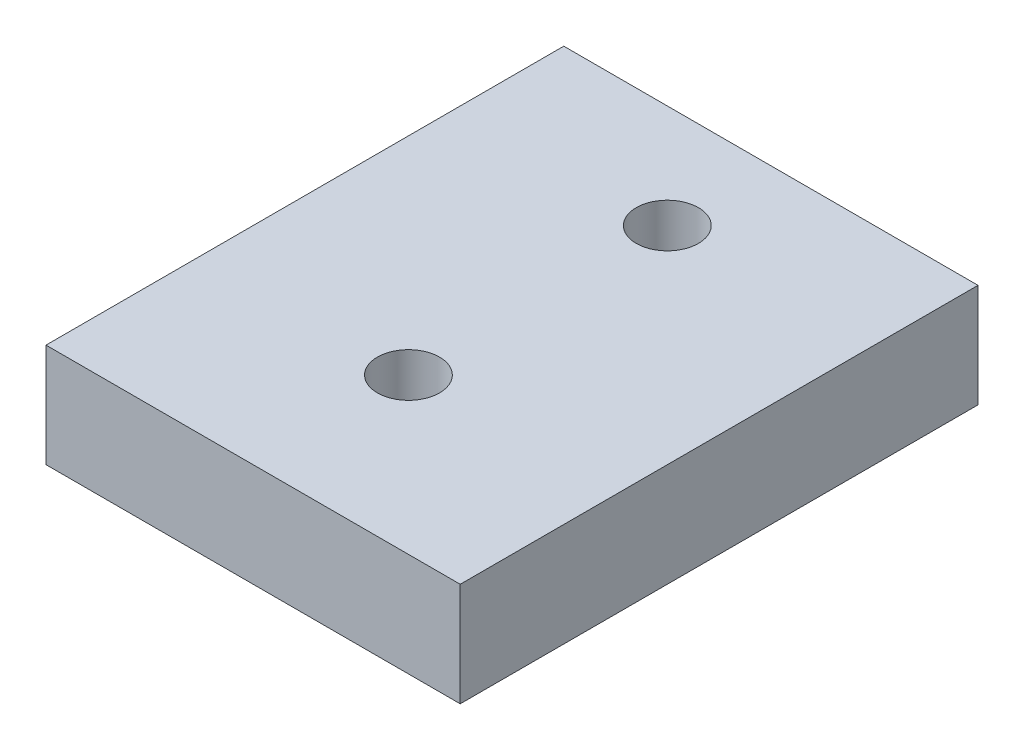
ISO-10303-21;
HEADER;
FILE_DESCRIPTION(('STEP AP214'),'2;1');
FILE_NAME('part.step','',(''),(''),'','','');
FILE_SCHEMA(('AUTOMOTIVE_DESIGN { 1 0 10303 214 1 1 1 1 }'));
ENDSEC;
DATA;
#1=APPLICATION_CONTEXT('core data for automotive mechanical design processes');
#2=APPLICATION_PROTOCOL_DEFINITION('international standard','automotive_design',2000,#1);
#3=PRODUCT_CONTEXT('',#1,'mechanical');
#4=PRODUCT('Part','Part','',(#3));
#5=PRODUCT_RELATED_PRODUCT_CATEGORY('part','',(#4));
#6=PRODUCT_DEFINITION_FORMATION('','',#4);
#7=PRODUCT_DEFINITION_CONTEXT('part definition',#1,'design');
#8=PRODUCT_DEFINITION('design','',#6,#7);
#9=PRODUCT_DEFINITION_SHAPE('','',#8);
#10=(LENGTH_UNIT() NAMED_UNIT(*) SI_UNIT(.MILLI.,.METRE.));
#11=(NAMED_UNIT(*) PLANE_ANGLE_UNIT() SI_UNIT($,.RADIAN.));
#12=(NAMED_UNIT(*) SI_UNIT($,.STERADIAN.) SOLID_ANGLE_UNIT());
#13=UNCERTAINTY_MEASURE_WITH_UNIT(LENGTH_MEASURE(1.E-05),#10,'distance_accuracy_value','');
#14=(GEOMETRIC_REPRESENTATION_CONTEXT(3) GLOBAL_UNCERTAINTY_ASSIGNED_CONTEXT((#13)) GLOBAL_UNIT_ASSIGNED_CONTEXT((#10,
#11,#12)) REPRESENTATION_CONTEXT('',''));
#15=CARTESIAN_POINT('',(0.,0.,0.));
#16=DIRECTION('',(0.,0.,1.));
#17=DIRECTION('',(1.,0.,0.));
#18=AXIS2_PLACEMENT_3D('',#15,#16,#17);
#19=CARTESIAN_POINT('',(0.,10.,0.));
#20=DIRECTION('',(0.,1.,0.));
#21=DIRECTION('',(0.,0.,1.));
#22=AXIS2_PLACEMENT_3D('',#19,#20,#21);
#23=PLANE('',#22);
#24=CARTESIAN_POINT('',(20.,10.,-15.));
#25=DIRECTION('',(0.,1.,0.));
#26=DIRECTION('',(0.,0.,1.));
#27=AXIS2_PLACEMENT_3D('',#24,#25,#26);
#28=CIRCLE('',#27,3.);
#29=CARTESIAN_POINT('',(20.,10.,-12.));
#30=VERTEX_POINT('',#29);
#31=EDGE_CURVE('E112',#30,#30,#28,.T.);
#32=ORIENTED_EDGE('',*,*,#31,.F.);
#33=EDGE_LOOP('',(#32));
#34=FACE_BOUND('',#33,.T.);
#35=DIRECTION('',(0.,0.,1.));
#36=VECTOR('',#35,1.);
#37=CARTESIAN_POINT('',(0.,10.,-50.));
#38=LINE('',#37,#36);
#39=CARTESIAN_POINT('',(0.,10.,-50.));
#40=VERTEX_POINT('',#39);
#41=CARTESIAN_POINT('',(0.,10.,0.));
#42=VERTEX_POINT('',#41);
#43=EDGE_CURVE('E92',#40,#42,#38,.T.);
#44=ORIENTED_EDGE('',*,*,#43,.T.);
#45=DIRECTION('',(1.,0.,0.));
#46=VECTOR('',#45,1.);
#47=CARTESIAN_POINT('',(0.,10.,0.));
#48=LINE('',#47,#46);
#49=CARTESIAN_POINT('',(40.,10.,0.));
#50=VERTEX_POINT('',#49);
#51=EDGE_CURVE('E87',#42,#50,#48,.T.);
#52=ORIENTED_EDGE('',*,*,#51,.T.);
#53=DIRECTION('',(0.,0.,-1.));
#54=VECTOR('',#53,1.);
#55=CARTESIAN_POINT('',(40.,10.,0.));
#56=LINE('',#55,#54);
#57=CARTESIAN_POINT('',(40.,10.,-50.));
#58=VERTEX_POINT('',#57);
#59=EDGE_CURVE('E90',#50,#58,#56,.T.);
#60=ORIENTED_EDGE('',*,*,#59,.T.);
#61=DIRECTION('',(-1.,0.,0.));
#62=VECTOR('',#61,1.);
#63=CARTESIAN_POINT('',(40.,10.,-50.));
#64=LINE('',#63,#62);
#65=EDGE_CURVE('E57',#58,#40,#64,.T.);
#66=ORIENTED_EDGE('',*,*,#65,.T.);
#67=EDGE_LOOP('',(#44,#52,#60,#66));
#68=FACE_BOUND('',#67,.T.);
#69=CARTESIAN_POINT('',(20.,10.,-40.));
#70=DIRECTION('',(0.,1.,0.));
#71=DIRECTION('',(0.,0.,1.));
#72=AXIS2_PLACEMENT_3D('',#69,#70,#71);
#73=CIRCLE('',#72,3.);
#74=CARTESIAN_POINT('',(20.,10.,-37.));
#75=VERTEX_POINT('',#74);
#76=EDGE_CURVE('E134',#75,#75,#73,.T.);
#77=ORIENTED_EDGE('',*,*,#76,.F.);
#78=EDGE_LOOP('',(#77));
#79=FACE_BOUND('',#78,.T.);
#80=ADVANCED_FACE('F39',(#34,#68,#79),#23,.T.);
#81=CARTESIAN_POINT('',(0.,0.,0.));
#82=DIRECTION('',(0.,1.,0.));
#83=DIRECTION('',(0.,0.,1.));
#84=AXIS2_PLACEMENT_3D('',#81,#82,#83);
#85=PLANE('',#84);
#86=DIRECTION('',(0.,0.,1.));
#87=VECTOR('',#86,1.);
#88=CARTESIAN_POINT('',(0.,0.,-50.));
#89=LINE('',#88,#87);
#90=CARTESIAN_POINT('',(0.,0.,-50.));
#91=VERTEX_POINT('',#90);
#92=CARTESIAN_POINT('',(0.,0.,0.));
#93=VERTEX_POINT('',#92);
#94=EDGE_CURVE('E108',#91,#93,#89,.T.);
#95=ORIENTED_EDGE('',*,*,#94,.F.);
#96=DIRECTION('',(-1.,0.,0.));
#97=VECTOR('',#96,1.);
#98=CARTESIAN_POINT('',(40.,0.,-50.));
#99=LINE('',#98,#97);
#100=CARTESIAN_POINT('',(40.,0.,-50.));
#101=VERTEX_POINT('',#100);
#102=EDGE_CURVE('E80',#101,#91,#99,.T.);
#103=ORIENTED_EDGE('',*,*,#102,.F.);
#104=DIRECTION('',(0.,0.,-1.));
#105=VECTOR('',#104,1.);
#106=CARTESIAN_POINT('',(40.,0.,0.));
#107=LINE('',#106,#105);
#108=CARTESIAN_POINT('',(40.,0.,0.));
#109=VERTEX_POINT('',#108);
#110=EDGE_CURVE('E74',#109,#101,#107,.T.);
#111=ORIENTED_EDGE('',*,*,#110,.F.);
#112=DIRECTION('',(1.,0.,0.));
#113=VECTOR('',#112,1.);
#114=CARTESIAN_POINT('',(0.,0.,0.));
#115=LINE('',#114,#113);
#116=EDGE_CURVE('E97',#93,#109,#115,.T.);
#117=ORIENTED_EDGE('',*,*,#116,.F.);
#118=EDGE_LOOP('',(#95,#103,#111,#117));
#119=FACE_BOUND('',#118,.T.);
#120=CARTESIAN_POINT('',(20.,0.,-15.));
#121=DIRECTION('',(0.,1.,0.));
#122=DIRECTION('',(0.,0.,1.));
#123=AXIS2_PLACEMENT_3D('',#120,#121,#122);
#124=CIRCLE('',#123,3.);
#125=CARTESIAN_POINT('',(20.,0.,-12.));
#126=VERTEX_POINT('',#125);
#127=EDGE_CURVE('E130',#126,#126,#124,.T.);
#128=ORIENTED_EDGE('',*,*,#127,.T.);
#129=EDGE_LOOP('',(#128));
#130=FACE_BOUND('',#129,.T.);
#131=CARTESIAN_POINT('',(20.,0.,-40.));
#132=DIRECTION('',(0.,1.,0.));
#133=DIRECTION('',(0.,0.,1.));
#134=AXIS2_PLACEMENT_3D('',#131,#132,#133);
#135=CIRCLE('',#134,3.);
#136=CARTESIAN_POINT('',(20.,0.,-37.));
#137=VERTEX_POINT('',#136);
#138=EDGE_CURVE('E138',#137,#137,#135,.T.);
#139=ORIENTED_EDGE('',*,*,#138,.T.);
#140=EDGE_LOOP('',(#139));
#141=FACE_BOUND('',#140,.T.);
#142=ADVANCED_FACE('F125',(#119,#130,#141),#85,.F.);
#143=CARTESIAN_POINT('',(0.,10.,-50.));
#144=DIRECTION('',(1.,0.,0.));
#145=DIRECTION('',(0.,0.,-1.));
#146=AXIS2_PLACEMENT_3D('',#143,#144,#145);
#147=PLANE('',#146);
#148=ORIENTED_EDGE('',*,*,#94,.T.);
#149=DIRECTION('',(0.,-1.,0.));
#150=VECTOR('',#149,1.);
#151=CARTESIAN_POINT('',(0.,10.,0.));
#152=LINE('',#151,#150);
#153=EDGE_CURVE('E11',#42,#93,#152,.T.);
#154=ORIENTED_EDGE('',*,*,#153,.F.);
#155=ORIENTED_EDGE('',*,*,#43,.F.);
#156=DIRECTION('',(0.,-1.,0.));
#157=VECTOR('',#156,1.);
#158=CARTESIAN_POINT('',(0.,10.,-50.));
#159=LINE('',#158,#157);
#160=EDGE_CURVE('E104',#40,#91,#159,.T.);
#161=ORIENTED_EDGE('',*,*,#160,.T.);
#162=EDGE_LOOP('',(#148,#154,#155,#161));
#163=FACE_BOUND('',#162,.T.);
#164=ADVANCED_FACE('F41',(#163),#147,.F.);
#165=CARTESIAN_POINT('',(0.,10.,0.));
#166=DIRECTION('',(0.,0.,-1.));
#167=DIRECTION('',(-1.,0.,0.));
#168=AXIS2_PLACEMENT_3D('',#165,#166,#167);
#169=PLANE('',#168);
#170=ORIENTED_EDGE('',*,*,#116,.T.);
#171=DIRECTION('',(0.,-1.,0.));
#172=VECTOR('',#171,1.);
#173=CARTESIAN_POINT('',(40.,10.,0.));
#174=LINE('',#173,#172);
#175=EDGE_CURVE('E49',#50,#109,#174,.T.);
#176=ORIENTED_EDGE('',*,*,#175,.F.);
#177=ORIENTED_EDGE('',*,*,#51,.F.);
#178=ORIENTED_EDGE('',*,*,#153,.T.);
#179=EDGE_LOOP('',(#170,#176,#177,#178));
#180=FACE_BOUND('',#179,.T.);
#181=ADVANCED_FACE('F96',(#180),#169,.F.);
#182=CARTESIAN_POINT('',(40.,10.,0.));
#183=DIRECTION('',(-1.,0.,0.));
#184=DIRECTION('',(0.,0.,1.));
#185=AXIS2_PLACEMENT_3D('',#182,#183,#184);
#186=PLANE('',#185);
#187=ORIENTED_EDGE('',*,*,#110,.T.);
#188=DIRECTION('',(0.,-1.,0.));
#189=VECTOR('',#188,1.);
#190=CARTESIAN_POINT('',(40.,10.,-50.));
#191=LINE('',#190,#189);
#192=EDGE_CURVE('E99',#58,#101,#191,.T.);
#193=ORIENTED_EDGE('',*,*,#192,.F.);
#194=ORIENTED_EDGE('',*,*,#59,.F.);
#195=ORIENTED_EDGE('',*,*,#175,.T.);
#196=EDGE_LOOP('',(#187,#193,#194,#195));
#197=FACE_BOUND('',#196,.T.);
#198=ADVANCED_FACE('F100',(#197),#186,.F.);
#199=CARTESIAN_POINT('',(40.,10.,-50.));
#200=DIRECTION('',(0.,0.,1.));
#201=DIRECTION('',(1.,0.,0.));
#202=AXIS2_PLACEMENT_3D('',#199,#200,#201);
#203=PLANE('',#202);
#204=ORIENTED_EDGE('',*,*,#102,.T.);
#205=ORIENTED_EDGE('',*,*,#160,.F.);
#206=ORIENTED_EDGE('',*,*,#65,.F.);
#207=ORIENTED_EDGE('',*,*,#192,.T.);
#208=EDGE_LOOP('',(#204,#205,#206,#207));
#209=FACE_BOUND('',#208,.T.);
#210=ADVANCED_FACE('F122',(#209),#203,.F.);
#211=CARTESIAN_POINT('',(20.,10.,-15.));
#212=DIRECTION('',(0.,-1.,0.));
#213=DIRECTION('',(0.,0.,-1.));
#214=AXIS2_PLACEMENT_3D('',#211,#212,#213);
#215=CYLINDRICAL_SURFACE('',#214,3.);
#216=ORIENTED_EDGE('',*,*,#31,.T.);
#217=EDGE_LOOP('',(#216));
#218=FACE_BOUND('',#217,.T.);
#219=ORIENTED_EDGE('',*,*,#127,.F.);
#220=EDGE_LOOP('',(#219));
#221=FACE_BOUND('',#220,.T.);
#222=ADVANCED_FACE('F157',(#218,#221),#215,.F.);
#223=CARTESIAN_POINT('',(20.,10.,-40.));
#224=DIRECTION('',(0.,-1.,0.));
#225=DIRECTION('',(0.,0.,-1.));
#226=AXIS2_PLACEMENT_3D('',#223,#224,#225);
#227=CYLINDRICAL_SURFACE('',#226,3.);
#228=ORIENTED_EDGE('',*,*,#76,.T.);
#229=EDGE_LOOP('',(#228));
#230=FACE_BOUND('',#229,.T.);
#231=ORIENTED_EDGE('',*,*,#138,.F.);
#232=EDGE_LOOP('',(#231));
#233=FACE_BOUND('',#232,.T.);
#234=ADVANCED_FACE('F146',(#230,#233),#227,.F.);
#235=CLOSED_SHELL('',(#80,#142,#164,#181,#198,#210,#222,#234));
#236=MANIFOLD_SOLID_BREP('B2',#235);
#237=ADVANCED_BREP_SHAPE_REPRESENTATION('',(#18,#236),#14);
#238=SHAPE_DEFINITION_REPRESENTATION(#9,#237);
ENDSEC;
END-ISO-10303-21;
